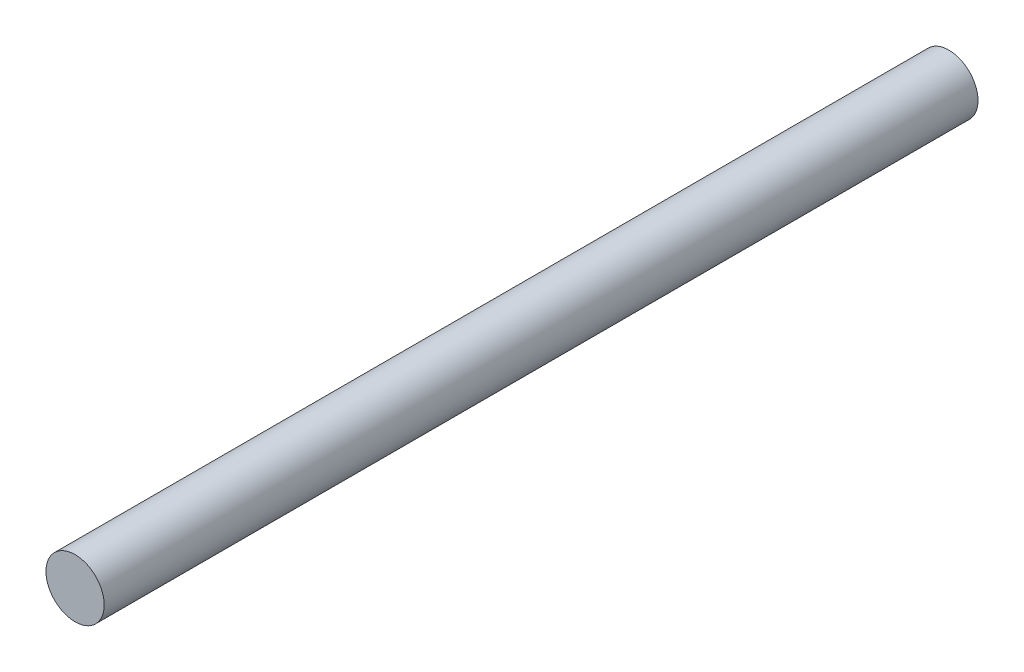
ISO-10303-21;
HEADER;
FILE_DESCRIPTION(('STEP AP214'),'2;1');
FILE_NAME('part.step','',(''),(''),'','','');
FILE_SCHEMA(('AUTOMOTIVE_DESIGN { 1 0 10303 214 1 1 1 1 }'));
ENDSEC;
DATA;
#1=APPLICATION_CONTEXT('core data for automotive mechanical design processes');
#2=APPLICATION_PROTOCOL_DEFINITION('international standard','automotive_design',2000,#1);
#3=PRODUCT_CONTEXT('',#1,'mechanical');
#4=PRODUCT('Part','Part','',(#3));
#5=PRODUCT_RELATED_PRODUCT_CATEGORY('part','',(#4));
#6=PRODUCT_DEFINITION_FORMATION('','',#4);
#7=PRODUCT_DEFINITION_CONTEXT('part definition',#1,'design');
#8=PRODUCT_DEFINITION('design','',#6,#7);
#9=PRODUCT_DEFINITION_SHAPE('','',#8);
#10=(LENGTH_UNIT() NAMED_UNIT(*) SI_UNIT(.MILLI.,.METRE.));
#11=(NAMED_UNIT(*) PLANE_ANGLE_UNIT() SI_UNIT($,.RADIAN.));
#12=(NAMED_UNIT(*) SI_UNIT($,.STERADIAN.) SOLID_ANGLE_UNIT());
#13=UNCERTAINTY_MEASURE_WITH_UNIT(LENGTH_MEASURE(1.E-05),#10,'distance_accuracy_value','');
#14=(GEOMETRIC_REPRESENTATION_CONTEXT(3) GLOBAL_UNCERTAINTY_ASSIGNED_CONTEXT((#13)) GLOBAL_UNIT_ASSIGNED_CONTEXT((#10,
#11,#12)) REPRESENTATION_CONTEXT('',''));
#15=CARTESIAN_POINT('',(0.,0.,0.));
#16=DIRECTION('',(0.,0.,1.));
#17=DIRECTION('',(1.,0.,0.));
#18=AXIS2_PLACEMENT_3D('',#15,#16,#17);
#19=CARTESIAN_POINT('',(0.,0.,120.));
#20=DIRECTION('',(0.,0.,-1.));
#21=DIRECTION('',(-1.,0.,0.));
#22=AXIS2_PLACEMENT_3D('',#19,#20,#21);
#23=CYLINDRICAL_SURFACE('',#22,4.);
#24=CARTESIAN_POINT('',(0.,0.,120.));
#25=DIRECTION('',(0.,0.,1.));
#26=DIRECTION('',(1.,0.,0.));
#27=AXIS2_PLACEMENT_3D('',#24,#25,#26);
#28=CIRCLE('',#27,4.);
#29=CARTESIAN_POINT('',(4.,0.,120.));
#30=VERTEX_POINT('',#29);
#31=EDGE_CURVE('E12',#30,#30,#28,.T.);
#32=ORIENTED_EDGE('',*,*,#31,.F.);
#33=EDGE_LOOP('',(#32));
#34=FACE_BOUND('',#33,.T.);
#35=CARTESIAN_POINT('',(0.,0.,0.));
#36=DIRECTION('',(0.,0.,1.));
#37=DIRECTION('',(1.,0.,0.));
#38=AXIS2_PLACEMENT_3D('',#35,#36,#37);
#39=CIRCLE('',#38,4.);
#40=CARTESIAN_POINT('',(4.,0.,0.));
#41=VERTEX_POINT('',#40);
#42=EDGE_CURVE('E45',#41,#41,#39,.T.);
#43=ORIENTED_EDGE('',*,*,#42,.T.);
#44=EDGE_LOOP('',(#43));
#45=FACE_BOUND('',#44,.T.);
#46=ADVANCED_FACE('F42',(#34,#45),#23,.T.);
#47=CARTESIAN_POINT('',(0.,0.,120.));
#48=DIRECTION('',(0.,0.,1.));
#49=DIRECTION('',(1.,0.,0.));
#50=AXIS2_PLACEMENT_3D('',#47,#48,#49);
#51=PLANE('',#50);
#52=ORIENTED_EDGE('',*,*,#31,.T.);
#53=EDGE_LOOP('',(#52));
#54=FACE_BOUND('',#53,.T.);
#55=ADVANCED_FACE('F57',(#54),#51,.T.);
#56=CARTESIAN_POINT('',(0.,0.,0.));
#57=DIRECTION('',(0.,0.,1.));
#58=DIRECTION('',(1.,0.,0.));
#59=AXIS2_PLACEMENT_3D('',#56,#57,#58);
#60=PLANE('',#59);
#61=ORIENTED_EDGE('',*,*,#42,.F.);
#62=EDGE_LOOP('',(#61));
#63=FACE_BOUND('',#62,.T.);
#64=ADVANCED_FACE('F55',(#63),#60,.F.);
#65=CLOSED_SHELL('',(#46,#55,#64));
#66=MANIFOLD_SOLID_BREP('B2',#65);
#67=ADVANCED_BREP_SHAPE_REPRESENTATION('',(#18,#66),#14);
#68=SHAPE_DEFINITION_REPRESENTATION(#9,#67);
ENDSEC;
END-ISO-10303-21;
